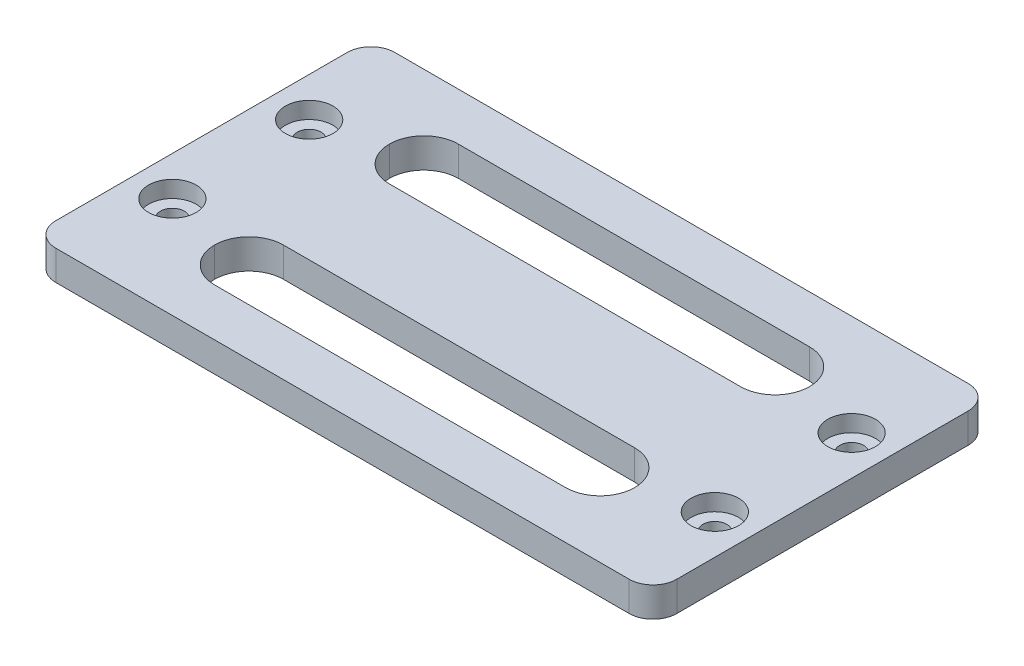
ISO-10303-21;
HEADER;
FILE_DESCRIPTION(('STEP AP214'),'2;1');
FILE_NAME('part.step','',(''),(''),'','','');
FILE_SCHEMA(('AUTOMOTIVE_DESIGN { 1 0 10303 214 1 1 1 1 }'));
ENDSEC;
DATA;
#1=APPLICATION_CONTEXT('core data for automotive mechanical design processes');
#2=APPLICATION_PROTOCOL_DEFINITION('international standard','automotive_design',2000,#1);
#3=PRODUCT_CONTEXT('',#1,'mechanical');
#4=PRODUCT('Part','Part','',(#3));
#5=PRODUCT_RELATED_PRODUCT_CATEGORY('part','',(#4));
#6=PRODUCT_DEFINITION_FORMATION('','',#4);
#7=PRODUCT_DEFINITION_CONTEXT('part definition',#1,'design');
#8=PRODUCT_DEFINITION('design','',#6,#7);
#9=PRODUCT_DEFINITION_SHAPE('','',#8);
#10=(LENGTH_UNIT() NAMED_UNIT(*) SI_UNIT(.MILLI.,.METRE.));
#11=(NAMED_UNIT(*) PLANE_ANGLE_UNIT() SI_UNIT($,.RADIAN.));
#12=(NAMED_UNIT(*) SI_UNIT($,.STERADIAN.) SOLID_ANGLE_UNIT());
#13=UNCERTAINTY_MEASURE_WITH_UNIT(LENGTH_MEASURE(1.E-05),#10,'distance_accuracy_value','');
#14=(GEOMETRIC_REPRESENTATION_CONTEXT(3) GLOBAL_UNCERTAINTY_ASSIGNED_CONTEXT((#13)) GLOBAL_UNIT_ASSIGNED_CONTEXT((#10,
#11,#12)) REPRESENTATION_CONTEXT('',''));
#15=CARTESIAN_POINT('',(0.,0.,0.));
#16=DIRECTION('',(0.,0.,1.));
#17=DIRECTION('',(1.,0.,0.));
#18=AXIS2_PLACEMENT_3D('',#15,#16,#17);
#19=CARTESIAN_POINT('',(22.8,2.5,-8.3));
#20=DIRECTION('',(0.,-1.,0.));
#21=DIRECTION('',(0.,0.,-1.));
#22=AXIS2_PLACEMENT_3D('',#19,#20,#21);
#23=CYLINDRICAL_SURFACE('',#22,1.);
#24=CARTESIAN_POINT('',(22.8,0.,-8.3));
#25=DIRECTION('',(0.,1.,0.));
#26=DIRECTION('',(0.,0.,1.));
#27=AXIS2_PLACEMENT_3D('',#24,#25,#26);
#28=CIRCLE('',#27,1.);
#29=CARTESIAN_POINT('',(22.8,0.,-7.29999999999999));
#30=VERTEX_POINT('',#29);
#31=EDGE_CURVE('E360',#30,#30,#28,.T.);
#32=ORIENTED_EDGE('',*,*,#31,.F.);
#33=EDGE_LOOP('',(#32));
#34=FACE_BOUND('',#33,.T.);
#35=CARTESIAN_POINT('',(22.8,1.1,-8.3));
#36=DIRECTION('',(0.,1.,0.));
#37=DIRECTION('',(0.,0.,1.));
#38=AXIS2_PLACEMENT_3D('',#35,#36,#37);
#39=CIRCLE('',#38,1.);
#40=CARTESIAN_POINT('',(22.8,1.1,-7.29999999999999));
#41=VERTEX_POINT('',#40);
#42=EDGE_CURVE('E40',#41,#41,#39,.T.);
#43=ORIENTED_EDGE('',*,*,#42,.T.);
#44=EDGE_LOOP('',(#43));
#45=FACE_BOUND('',#44,.T.);
#46=ADVANCED_FACE('F36',(#34,#45),#23,.F.);
#47=CARTESIAN_POINT('',(22.8,2.5,3.2));
#48=DIRECTION('',(0.,-1.,0.));
#49=DIRECTION('',(0.,0.,-1.));
#50=AXIS2_PLACEMENT_3D('',#47,#48,#49);
#51=CYLINDRICAL_SURFACE('',#50,1.);
#52=CARTESIAN_POINT('',(22.8,0.,3.2));
#53=DIRECTION('',(0.,1.,0.));
#54=DIRECTION('',(0.,0.,-1.));
#55=AXIS2_PLACEMENT_3D('',#52,#53,#54);
#56=CIRCLE('',#55,1.);
#57=CARTESIAN_POINT('',(22.8,0.,2.19999999999999));
#58=VERTEX_POINT('',#57);
#59=EDGE_CURVE('E363',#58,#58,#56,.T.);
#60=ORIENTED_EDGE('',*,*,#59,.F.);
#61=EDGE_LOOP('',(#60));
#62=FACE_BOUND('',#61,.T.);
#63=CARTESIAN_POINT('',(22.8,1.1,3.2));
#64=DIRECTION('',(0.,1.,0.));
#65=DIRECTION('',(0.,0.,1.));
#66=AXIS2_PLACEMENT_3D('',#63,#64,#65);
#67=CIRCLE('',#66,1.);
#68=CARTESIAN_POINT('',(22.8,1.1,4.2));
#69=VERTEX_POINT('',#68);
#70=EDGE_CURVE('E310',#69,#69,#67,.T.);
#71=ORIENTED_EDGE('',*,*,#70,.T.);
#72=EDGE_LOOP('',(#71));
#73=FACE_BOUND('',#72,.T.);
#74=ADVANCED_FACE('F414',(#62,#73),#51,.F.);
#75=CARTESIAN_POINT('',(-22.8,2.5,3.2));
#76=DIRECTION('',(0.,-1.,0.));
#77=DIRECTION('',(0.,0.,-1.));
#78=AXIS2_PLACEMENT_3D('',#75,#76,#77);
#79=CYLINDRICAL_SURFACE('',#78,1.);
#80=CARTESIAN_POINT('',(-22.8,0.,3.2));
#81=DIRECTION('',(0.,1.,0.));
#82=DIRECTION('',(0.,0.,1.));
#83=AXIS2_PLACEMENT_3D('',#80,#81,#82);
#84=CIRCLE('',#83,1.);
#85=CARTESIAN_POINT('',(-22.8,0.,4.2));
#86=VERTEX_POINT('',#85);
#87=EDGE_CURVE('E207',#86,#86,#84,.T.);
#88=ORIENTED_EDGE('',*,*,#87,.F.);
#89=EDGE_LOOP('',(#88));
#90=FACE_BOUND('',#89,.T.);
#91=CARTESIAN_POINT('',(-22.8,1.1,3.2));
#92=DIRECTION('',(0.,1.,0.));
#93=DIRECTION('',(0.,0.,1.));
#94=AXIS2_PLACEMENT_3D('',#91,#92,#93);
#95=CIRCLE('',#94,1.);
#96=CARTESIAN_POINT('',(-22.8,1.1,4.2));
#97=VERTEX_POINT('',#96);
#98=EDGE_CURVE('E306',#97,#97,#95,.T.);
#99=ORIENTED_EDGE('',*,*,#98,.T.);
#100=EDGE_LOOP('',(#99));
#101=FACE_BOUND('',#100,.T.);
#102=ADVANCED_FACE('F420',(#90,#101),#79,.F.);
#103=CARTESIAN_POINT('',(-22.8,2.5,-8.29999999999999));
#104=DIRECTION('',(0.,-1.,0.));
#105=DIRECTION('',(0.,0.,-1.));
#106=AXIS2_PLACEMENT_3D('',#103,#104,#105);
#107=CYLINDRICAL_SURFACE('',#106,1.);
#108=CARTESIAN_POINT('',(-22.8,0.,-8.29999999999999));
#109=DIRECTION('',(0.,1.,0.));
#110=DIRECTION('',(0.,0.,-1.));
#111=AXIS2_PLACEMENT_3D('',#108,#109,#110);
#112=CIRCLE('',#111,1.);
#113=CARTESIAN_POINT('',(-22.8,0.,-9.29999999999999));
#114=VERTEX_POINT('',#113);
#115=EDGE_CURVE('E354',#114,#114,#112,.T.);
#116=ORIENTED_EDGE('',*,*,#115,.F.);
#117=EDGE_LOOP('',(#116));
#118=FACE_BOUND('',#117,.T.);
#119=CARTESIAN_POINT('',(-22.8,1.1,-8.29999999999999));
#120=DIRECTION('',(0.,1.,0.));
#121=DIRECTION('',(0.,0.,1.));
#122=AXIS2_PLACEMENT_3D('',#119,#120,#121);
#123=CIRCLE('',#122,1.);
#124=CARTESIAN_POINT('',(-22.8,1.1,-7.29999999999999));
#125=VERTEX_POINT('',#124);
#126=EDGE_CURVE('E302',#125,#125,#123,.T.);
#127=ORIENTED_EDGE('',*,*,#126,.T.);
#128=EDGE_LOOP('',(#127));
#129=FACE_BOUND('',#128,.T.);
#130=ADVANCED_FACE('F426',(#118,#129),#107,.F.);
#131=CARTESIAN_POINT('',(0.,2.5,0.));
#132=DIRECTION('',(0.,-1.,0.));
#133=DIRECTION('',(0.,0.,-1.));
#134=AXIS2_PLACEMENT_3D('',#131,#132,#133);
#135=PLANE('',#134);
#136=CARTESIAN_POINT('',(22.8,2.5,-8.3));
#137=DIRECTION('',(0.,1.,0.));
#138=DIRECTION('',(0.,0.,1.));
#139=AXIS2_PLACEMENT_3D('',#136,#137,#138);
#140=CIRCLE('',#139,2.);
#141=CARTESIAN_POINT('',(22.8,2.5,-6.29999999999999));
#142=VERTEX_POINT('',#141);
#143=EDGE_CURVE('E326',#142,#142,#140,.T.);
#144=ORIENTED_EDGE('',*,*,#143,.F.);
#145=EDGE_LOOP('',(#144));
#146=FACE_BOUND('',#145,.T.);
#147=CARTESIAN_POINT('',(22.8,2.5,3.2));
#148=DIRECTION('',(0.,1.,0.));
#149=DIRECTION('',(0.,0.,1.));
#150=AXIS2_PLACEMENT_3D('',#147,#148,#149);
#151=CIRCLE('',#150,2.);
#152=CARTESIAN_POINT('',(22.8,2.5,5.2));
#153=VERTEX_POINT('',#152);
#154=EDGE_CURVE('E319',#153,#153,#151,.T.);
#155=ORIENTED_EDGE('',*,*,#154,.F.);
#156=EDGE_LOOP('',(#155));
#157=FACE_BOUND('',#156,.T.);
#158=CARTESIAN_POINT('',(-22.8,2.5,3.2));
#159=DIRECTION('',(0.,1.,0.));
#160=DIRECTION('',(0.,0.,1.));
#161=AXIS2_PLACEMENT_3D('',#158,#159,#160);
#162=CIRCLE('',#161,2.);
#163=CARTESIAN_POINT('',(-22.8,2.5,5.2));
#164=VERTEX_POINT('',#163);
#165=EDGE_CURVE('E312',#164,#164,#162,.T.);
#166=ORIENTED_EDGE('',*,*,#165,.F.);
#167=EDGE_LOOP('',(#166));
#168=FACE_BOUND('',#167,.T.);
#169=CARTESIAN_POINT('',(-22.8,2.5,-8.29999999999999));
#170=DIRECTION('',(0.,1.,0.));
#171=DIRECTION('',(0.,0.,1.));
#172=AXIS2_PLACEMENT_3D('',#169,#170,#171);
#173=CIRCLE('',#172,2.);
#174=CARTESIAN_POINT('',(-22.8,2.5,-6.29999999999999));
#175=VERTEX_POINT('',#174);
#176=EDGE_CURVE('E308',#175,#175,#173,.T.);
#177=ORIENTED_EDGE('',*,*,#176,.F.);
#178=EDGE_LOOP('',(#177));
#179=FACE_BOUND('',#178,.T.);
#180=DIRECTION('',(-1.,0.,0.));
#181=VECTOR('',#180,1.);
#182=CARTESIAN_POINT('',(-17.6603184164153,2.5,-12.8));
#183=LINE('',#182,#181);
#184=CARTESIAN_POINT('',(14.7603184164153,2.5,-12.8));
#185=VERTEX_POINT('',#184);
#186=CARTESIAN_POINT('',(-14.7603184164153,2.5,-12.8));
#187=VERTEX_POINT('',#186);
#188=EDGE_CURVE('E347',#185,#187,#183,.T.);
#189=ORIENTED_EDGE('',*,*,#188,.F.);
#190=CARTESIAN_POINT('',(14.7603184164153,2.5,-9.90000000000001));
#191=DIRECTION('',(0.,-1.,0.));
#192=DIRECTION('',(0.,0.,-1.));
#193=AXIS2_PLACEMENT_3D('',#190,#191,#192);
#194=CIRCLE('',#193,2.9);
#195=CARTESIAN_POINT('',(17.6603184164153,2.5,-9.90000000000001));
#196=VERTEX_POINT('',#195);
#197=EDGE_CURVE('E267',#185,#196,#194,.T.);
#198=ORIENTED_EDGE('',*,*,#197,.T.);
#199=CARTESIAN_POINT('',(14.7603184164153,2.5,-9.90000000000001));
#200=DIRECTION('',(0.,-1.,0.));
#201=DIRECTION('',(0.,0.,-1.));
#202=AXIS2_PLACEMENT_3D('',#199,#200,#201);
#203=CIRCLE('',#202,2.9);
#204=CARTESIAN_POINT('',(14.7603184164153,2.5,-7.00000000000001));
#205=VERTEX_POINT('',#204);
#206=EDGE_CURVE('E263',#196,#205,#203,.T.);
#207=ORIENTED_EDGE('',*,*,#206,.T.);
#208=DIRECTION('',(1.,0.,0.));
#209=VECTOR('',#208,1.);
#210=CARTESIAN_POINT('',(-17.6603184164153,2.5,-7.00000000000001));
#211=LINE('',#210,#209);
#212=CARTESIAN_POINT('',(-14.7603184164153,2.5,-7.00000000000001));
#213=VERTEX_POINT('',#212);
#214=EDGE_CURVE('E350',#213,#205,#211,.T.);
#215=ORIENTED_EDGE('',*,*,#214,.F.);
#216=CARTESIAN_POINT('',(-14.7603184164153,2.5,-9.90000000000001));
#217=DIRECTION('',(0.,-1.,0.));
#218=DIRECTION('',(0.,0.,-1.));
#219=AXIS2_PLACEMENT_3D('',#216,#217,#218);
#220=CIRCLE('',#219,2.9);
#221=CARTESIAN_POINT('',(-17.6603184164153,2.5,-9.90000000000001));
#222=VERTEX_POINT('',#221);
#223=EDGE_CURVE('E52',#213,#222,#220,.T.);
#224=ORIENTED_EDGE('',*,*,#223,.T.);
#225=CARTESIAN_POINT('',(-14.7603184164153,2.5,-9.90000000000001));
#226=DIRECTION('',(0.,-1.,0.));
#227=DIRECTION('',(0.,0.,-1.));
#228=AXIS2_PLACEMENT_3D('',#225,#226,#227);
#229=CIRCLE('',#228,2.9);
#230=EDGE_CURVE('E11',#222,#187,#229,.T.);
#231=ORIENTED_EDGE('',*,*,#230,.T.);
#232=EDGE_LOOP('',(#189,#198,#207,#215,#224,#231));
#233=FACE_BOUND('',#232,.T.);
#234=DIRECTION('',(0.,0.,-1.));
#235=VECTOR('',#234,1.);
#236=CARTESIAN_POINT('',(26.1,2.5,11.7));
#237=LINE('',#236,#235);
#238=CARTESIAN_POINT('',(26.1,2.5,9.7));
#239=VERTEX_POINT('',#238);
#240=CARTESIAN_POINT('',(26.1,2.5,-14.8));
#241=VERTEX_POINT('',#240);
#242=EDGE_CURVE('E213',#239,#241,#237,.T.);
#243=ORIENTED_EDGE('',*,*,#242,.T.);
#244=CARTESIAN_POINT('',(24.1,2.5,-14.8));
#245=DIRECTION('',(0.,-1.,0.));
#246=DIRECTION('',(0.,0.,-1.));
#247=AXIS2_PLACEMENT_3D('',#244,#245,#246);
#248=CIRCLE('',#247,2.);
#249=CARTESIAN_POINT('',(24.1,2.5,-16.8));
#250=VERTEX_POINT('',#249);
#251=EDGE_CURVE('E229',#241,#250,#248,.F.);
#252=ORIENTED_EDGE('',*,*,#251,.T.);
#253=DIRECTION('',(-1.,0.,0.));
#254=VECTOR('',#253,1.);
#255=CARTESIAN_POINT('',(-26.1,2.5,-16.8));
#256=LINE('',#255,#254);
#257=CARTESIAN_POINT('',(-24.1,2.5,-16.8));
#258=VERTEX_POINT('',#257);
#259=EDGE_CURVE('E194',#250,#258,#256,.T.);
#260=ORIENTED_EDGE('',*,*,#259,.T.);
#261=CARTESIAN_POINT('',(-24.1,2.5,-14.8));
#262=DIRECTION('',(0.,-1.,0.));
#263=DIRECTION('',(0.,0.,-1.));
#264=AXIS2_PLACEMENT_3D('',#261,#262,#263);
#265=CIRCLE('',#264,2.);
#266=CARTESIAN_POINT('',(-26.1,2.5,-14.8));
#267=VERTEX_POINT('',#266);
#268=EDGE_CURVE('E223',#258,#267,#265,.F.);
#269=ORIENTED_EDGE('',*,*,#268,.T.);
#270=DIRECTION('',(0.,0.,1.));
#271=VECTOR('',#270,1.);
#272=CARTESIAN_POINT('',(-26.1,2.5,11.7));
#273=LINE('',#272,#271);
#274=CARTESIAN_POINT('',(-26.1,2.5,9.7));
#275=VERTEX_POINT('',#274);
#276=EDGE_CURVE('E371',#267,#275,#273,.T.);
#277=ORIENTED_EDGE('',*,*,#276,.T.);
#278=CARTESIAN_POINT('',(-24.1,2.5,9.7));
#279=DIRECTION('',(0.,-1.,0.));
#280=DIRECTION('',(0.,0.,-1.));
#281=AXIS2_PLACEMENT_3D('',#278,#279,#280);
#282=CIRCLE('',#281,2.);
#283=CARTESIAN_POINT('',(-24.1,2.5,11.7));
#284=VERTEX_POINT('',#283);
#285=EDGE_CURVE('E225',#275,#284,#282,.F.);
#286=ORIENTED_EDGE('',*,*,#285,.T.);
#287=DIRECTION('',(1.,0.,0.));
#288=VECTOR('',#287,1.);
#289=CARTESIAN_POINT('',(-26.1,2.5,11.7));
#290=LINE('',#289,#288);
#291=CARTESIAN_POINT('',(24.1,2.5,11.7));
#292=VERTEX_POINT('',#291);
#293=EDGE_CURVE('E214',#284,#292,#290,.T.);
#294=ORIENTED_EDGE('',*,*,#293,.T.);
#295=CARTESIAN_POINT('',(24.1,2.5,9.7));
#296=DIRECTION('',(0.,-1.,0.));
#297=DIRECTION('',(0.,0.,-1.));
#298=AXIS2_PLACEMENT_3D('',#295,#296,#297);
#299=CIRCLE('',#298,2.);
#300=EDGE_CURVE('E227',#292,#239,#299,.F.);
#301=ORIENTED_EDGE('',*,*,#300,.T.);
#302=EDGE_LOOP('',(#243,#252,#260,#269,#277,#286,#294,#301));
#303=FACE_BOUND('',#302,.T.);
#304=CARTESIAN_POINT('',(-14.7603184164153,2.5,4.80000000000001));
#305=DIRECTION('',(0.,-1.,0.));
#306=DIRECTION('',(0.,0.,-1.));
#307=AXIS2_PLACEMENT_3D('',#304,#305,#306);
#308=CIRCLE('',#307,2.9);
#309=CARTESIAN_POINT('',(-14.7603184164153,2.5,7.70000000000001));
#310=VERTEX_POINT('',#309);
#311=CARTESIAN_POINT('',(-17.6603184164153,2.5,4.80000000000001));
#312=VERTEX_POINT('',#311);
#313=EDGE_CURVE('E279',#310,#312,#308,.T.);
#314=ORIENTED_EDGE('',*,*,#313,.T.);
#315=CARTESIAN_POINT('',(-14.7603184164153,2.5,4.80000000000001));
#316=DIRECTION('',(0.,-1.,0.));
#317=DIRECTION('',(0.,0.,-1.));
#318=AXIS2_PLACEMENT_3D('',#315,#316,#317);
#319=CIRCLE('',#318,2.9);
#320=CARTESIAN_POINT('',(-14.7603184164153,2.5,1.90000000000001));
#321=VERTEX_POINT('',#320);
#322=EDGE_CURVE('E283',#312,#321,#319,.T.);
#323=ORIENTED_EDGE('',*,*,#322,.T.);
#324=DIRECTION('',(-1.,0.,0.));
#325=VECTOR('',#324,1.);
#326=CARTESIAN_POINT('',(-17.6603184164153,2.5,1.90000000000001));
#327=LINE('',#326,#325);
#328=CARTESIAN_POINT('',(14.7603184164153,2.5,1.90000000000001));
#329=VERTEX_POINT('',#328);
#330=EDGE_CURVE('E338',#329,#321,#327,.T.);
#331=ORIENTED_EDGE('',*,*,#330,.F.);
#332=CARTESIAN_POINT('',(14.7603184164153,2.5,4.80000000000001));
#333=DIRECTION('',(0.,-1.,0.));
#334=DIRECTION('',(0.,0.,-1.));
#335=AXIS2_PLACEMENT_3D('',#332,#333,#334);
#336=CIRCLE('',#335,2.9);
#337=CARTESIAN_POINT('',(17.6603184164153,2.5,4.80000000000001));
#338=VERTEX_POINT('',#337);
#339=EDGE_CURVE('E275',#329,#338,#336,.T.);
#340=ORIENTED_EDGE('',*,*,#339,.T.);
#341=CARTESIAN_POINT('',(14.7603184164153,2.5,4.80000000000001));
#342=DIRECTION('',(0.,-1.,0.));
#343=DIRECTION('',(0.,0.,-1.));
#344=AXIS2_PLACEMENT_3D('',#341,#342,#343);
#345=CIRCLE('',#344,2.9);
#346=CARTESIAN_POINT('',(14.7603184164153,2.5,7.70000000000001));
#347=VERTEX_POINT('',#346);
#348=EDGE_CURVE('E271',#338,#347,#345,.T.);
#349=ORIENTED_EDGE('',*,*,#348,.T.);
#350=DIRECTION('',(1.,0.,0.));
#351=VECTOR('',#350,1.);
#352=CARTESIAN_POINT('',(-17.6603184164153,2.5,7.70000000000001));
#353=LINE('',#352,#351);
#354=EDGE_CURVE('E335',#310,#347,#353,.T.);
#355=ORIENTED_EDGE('',*,*,#354,.F.);
#356=EDGE_LOOP('',(#314,#323,#331,#340,#349,#355));
#357=FACE_BOUND('',#356,.T.);
#358=ADVANCED_FACE('F377',(#146,#157,#168,#179,#233,#303,#357),#135,.F.);
#359=CARTESIAN_POINT('',(0.,0.,0.));
#360=DIRECTION('',(0.,-1.,0.));
#361=DIRECTION('',(0.,0.,-1.));
#362=AXIS2_PLACEMENT_3D('',#359,#360,#361);
#363=PLANE('',#362);
#364=DIRECTION('',(-1.,0.,0.));
#365=VECTOR('',#364,1.);
#366=CARTESIAN_POINT('',(-17.6603184164153,0.,-12.8));
#367=LINE('',#366,#365);
#368=CARTESIAN_POINT('',(14.7603184164153,0.,-12.8));
#369=VERTEX_POINT('',#368);
#370=CARTESIAN_POINT('',(-14.7603184164153,0.,-12.8));
#371=VERTEX_POINT('',#370);
#372=EDGE_CURVE('E342',#369,#371,#367,.T.);
#373=ORIENTED_EDGE('',*,*,#372,.T.);
#374=CARTESIAN_POINT('',(-14.7603184164153,0.,-9.90000000000001));
#375=DIRECTION('',(0.,-1.,0.));
#376=DIRECTION('',(0.,0.,-1.));
#377=AXIS2_PLACEMENT_3D('',#374,#375,#376);
#378=CIRCLE('',#377,2.9);
#379=CARTESIAN_POINT('',(-17.6603184164153,0.,-9.90000000000001));
#380=VERTEX_POINT('',#379);
#381=EDGE_CURVE('E45',#371,#380,#378,.F.);
#382=ORIENTED_EDGE('',*,*,#381,.T.);
#383=CARTESIAN_POINT('',(-14.7603184164153,0.,-9.90000000000001));
#384=DIRECTION('',(0.,-1.,0.));
#385=DIRECTION('',(0.,0.,-1.));
#386=AXIS2_PLACEMENT_3D('',#383,#384,#385);
#387=CIRCLE('',#386,2.9);
#388=CARTESIAN_POINT('',(-14.7603184164153,0.,-7.00000000000001));
#389=VERTEX_POINT('',#388);
#390=EDGE_CURVE('E285',#380,#389,#387,.F.);
#391=ORIENTED_EDGE('',*,*,#390,.T.);
#392=DIRECTION('',(1.,0.,0.));
#393=VECTOR('',#392,1.);
#394=CARTESIAN_POINT('',(-17.6603184164153,0.,-7.00000000000001));
#395=LINE('',#394,#393);
#396=CARTESIAN_POINT('',(14.7603184164153,0.,-7.00000000000001));
#397=VERTEX_POINT('',#396);
#398=EDGE_CURVE('E351',#389,#397,#395,.T.);
#399=ORIENTED_EDGE('',*,*,#398,.T.);
#400=CARTESIAN_POINT('',(14.7603184164153,0.,-9.90000000000001));
#401=DIRECTION('',(0.,-1.,0.));
#402=DIRECTION('',(0.,0.,-1.));
#403=AXIS2_PLACEMENT_3D('',#400,#401,#402);
#404=CIRCLE('',#403,2.9);
#405=CARTESIAN_POINT('',(17.6603184164153,0.,-9.90000000000001));
#406=VERTEX_POINT('',#405);
#407=EDGE_CURVE('E261',#397,#406,#404,.F.);
#408=ORIENTED_EDGE('',*,*,#407,.T.);
#409=CARTESIAN_POINT('',(14.7603184164153,0.,-9.90000000000001));
#410=DIRECTION('',(0.,-1.,0.));
#411=DIRECTION('',(0.,0.,-1.));
#412=AXIS2_PLACEMENT_3D('',#409,#410,#411);
#413=CIRCLE('',#412,2.9);
#414=EDGE_CURVE('E265',#406,#369,#413,.F.);
#415=ORIENTED_EDGE('',*,*,#414,.T.);
#416=EDGE_LOOP('',(#373,#382,#391,#399,#408,#415));
#417=FACE_BOUND('',#416,.T.);
#418=ORIENTED_EDGE('',*,*,#31,.T.);
#419=EDGE_LOOP('',(#418));
#420=FACE_BOUND('',#419,.T.);
#421=ORIENTED_EDGE('',*,*,#87,.T.);
#422=EDGE_LOOP('',(#421));
#423=FACE_BOUND('',#422,.T.);
#424=DIRECTION('',(-1.,0.,0.));
#425=VECTOR('',#424,1.);
#426=CARTESIAN_POINT('',(-26.1,0.,-16.8));
#427=LINE('',#426,#425);
#428=CARTESIAN_POINT('',(24.1,0.,-16.8));
#429=VERTEX_POINT('',#428);
#430=CARTESIAN_POINT('',(-24.1,0.,-16.8));
#431=VERTEX_POINT('',#430);
#432=EDGE_CURVE('E191',#429,#431,#427,.T.);
#433=ORIENTED_EDGE('',*,*,#432,.F.);
#434=CARTESIAN_POINT('',(24.1,0.,-14.8));
#435=DIRECTION('',(0.,-1.,0.));
#436=DIRECTION('',(0.,0.,-1.));
#437=AXIS2_PLACEMENT_3D('',#434,#435,#436);
#438=CIRCLE('',#437,2.);
#439=CARTESIAN_POINT('',(26.1,0.,-14.8));
#440=VERTEX_POINT('',#439);
#441=EDGE_CURVE('E174',#429,#440,#438,.T.);
#442=ORIENTED_EDGE('',*,*,#441,.T.);
#443=DIRECTION('',(0.,0.,-1.));
#444=VECTOR('',#443,1.);
#445=CARTESIAN_POINT('',(26.1,0.,11.7));
#446=LINE('',#445,#444);
#447=CARTESIAN_POINT('',(26.1,0.,9.7));
#448=VERTEX_POINT('',#447);
#449=EDGE_CURVE('E202',#448,#440,#446,.T.);
#450=ORIENTED_EDGE('',*,*,#449,.F.);
#451=CARTESIAN_POINT('',(24.1,0.,9.7));
#452=DIRECTION('',(0.,-1.,0.));
#453=DIRECTION('',(0.,0.,-1.));
#454=AXIS2_PLACEMENT_3D('',#451,#452,#453);
#455=CIRCLE('',#454,2.);
#456=CARTESIAN_POINT('',(24.1,0.,11.7));
#457=VERTEX_POINT('',#456);
#458=EDGE_CURVE('E185',#448,#457,#455,.T.);
#459=ORIENTED_EDGE('',*,*,#458,.T.);
#460=DIRECTION('',(1.,0.,0.));
#461=VECTOR('',#460,1.);
#462=CARTESIAN_POINT('',(-26.1,0.,11.7));
#463=LINE('',#462,#461);
#464=CARTESIAN_POINT('',(-24.1,0.,11.7));
#465=VERTEX_POINT('',#464);
#466=EDGE_CURVE('E205',#465,#457,#463,.T.);
#467=ORIENTED_EDGE('',*,*,#466,.F.);
#468=CARTESIAN_POINT('',(-24.1,0.,9.7));
#469=DIRECTION('',(0.,-1.,0.));
#470=DIRECTION('',(0.,0.,-1.));
#471=AXIS2_PLACEMENT_3D('',#468,#469,#470);
#472=CIRCLE('',#471,2.);
#473=CARTESIAN_POINT('',(-26.1,0.,9.7));
#474=VERTEX_POINT('',#473);
#475=EDGE_CURVE('E217',#465,#474,#472,.T.);
#476=ORIENTED_EDGE('',*,*,#475,.T.);
#477=DIRECTION('',(0.,0.,1.));
#478=VECTOR('',#477,1.);
#479=CARTESIAN_POINT('',(-26.1,0.,11.7));
#480=LINE('',#479,#478);
#481=CARTESIAN_POINT('',(-26.1,0.,-14.8));
#482=VERTEX_POINT('',#481);
#483=EDGE_CURVE('E201',#482,#474,#480,.T.);
#484=ORIENTED_EDGE('',*,*,#483,.F.);
#485=CARTESIAN_POINT('',(-24.1,0.,-14.8));
#486=DIRECTION('',(0.,-1.,0.));
#487=DIRECTION('',(0.,0.,-1.));
#488=AXIS2_PLACEMENT_3D('',#485,#486,#487);
#489=CIRCLE('',#488,2.);
#490=EDGE_CURVE('E195',#482,#431,#489,.T.);
#491=ORIENTED_EDGE('',*,*,#490,.T.);
#492=EDGE_LOOP('',(#433,#442,#450,#459,#467,#476,#484,#491));
#493=FACE_BOUND('',#492,.T.);
#494=ORIENTED_EDGE('',*,*,#59,.T.);
#495=EDGE_LOOP('',(#494));
#496=FACE_BOUND('',#495,.T.);
#497=ORIENTED_EDGE('',*,*,#115,.T.);
#498=EDGE_LOOP('',(#497));
#499=FACE_BOUND('',#498,.T.);
#500=CARTESIAN_POINT('',(14.7603184164153,0.,4.80000000000001));
#501=DIRECTION('',(0.,-1.,0.));
#502=DIRECTION('',(0.,0.,-1.));
#503=AXIS2_PLACEMENT_3D('',#500,#501,#502);
#504=CIRCLE('',#503,2.9);
#505=CARTESIAN_POINT('',(14.7603184164153,0.,7.70000000000001));
#506=VERTEX_POINT('',#505);
#507=CARTESIAN_POINT('',(17.6603184164153,0.,4.80000000000001));
#508=VERTEX_POINT('',#507);
#509=EDGE_CURVE('E269',#506,#508,#504,.F.);
#510=ORIENTED_EDGE('',*,*,#509,.T.);
#511=CARTESIAN_POINT('',(14.7603184164153,0.,4.80000000000001));
#512=DIRECTION('',(0.,-1.,0.));
#513=DIRECTION('',(0.,0.,-1.));
#514=AXIS2_PLACEMENT_3D('',#511,#512,#513);
#515=CIRCLE('',#514,2.9);
#516=CARTESIAN_POINT('',(14.7603184164153,0.,1.90000000000001));
#517=VERTEX_POINT('',#516);
#518=EDGE_CURVE('E273',#508,#517,#515,.F.);
#519=ORIENTED_EDGE('',*,*,#518,.T.);
#520=DIRECTION('',(-1.,0.,0.));
#521=VECTOR('',#520,1.);
#522=CARTESIAN_POINT('',(-17.6603184164153,0.,1.90000000000001));
#523=LINE('',#522,#521);
#524=CARTESIAN_POINT('',(-14.7603184164153,0.,1.90000000000001));
#525=VERTEX_POINT('',#524);
#526=EDGE_CURVE('E339',#517,#525,#523,.T.);
#527=ORIENTED_EDGE('',*,*,#526,.T.);
#528=CARTESIAN_POINT('',(-14.7603184164153,0.,4.80000000000001));
#529=DIRECTION('',(0.,-1.,0.));
#530=DIRECTION('',(0.,0.,-1.));
#531=AXIS2_PLACEMENT_3D('',#528,#529,#530);
#532=CIRCLE('',#531,2.9);
#533=CARTESIAN_POINT('',(-17.6603184164153,0.,4.80000000000001));
#534=VERTEX_POINT('',#533);
#535=EDGE_CURVE('E281',#525,#534,#532,.F.);
#536=ORIENTED_EDGE('',*,*,#535,.T.);
#537=CARTESIAN_POINT('',(-14.7603184164153,0.,4.80000000000001));
#538=DIRECTION('',(0.,-1.,0.));
#539=DIRECTION('',(0.,0.,-1.));
#540=AXIS2_PLACEMENT_3D('',#537,#538,#539);
#541=CIRCLE('',#540,2.9);
#542=CARTESIAN_POINT('',(-14.7603184164153,0.,7.70000000000001));
#543=VERTEX_POINT('',#542);
#544=EDGE_CURVE('E277',#534,#543,#541,.F.);
#545=ORIENTED_EDGE('',*,*,#544,.T.);
#546=DIRECTION('',(1.,0.,0.));
#547=VECTOR('',#546,1.);
#548=CARTESIAN_POINT('',(-17.6603184164153,0.,7.70000000000001));
#549=LINE('',#548,#547);
#550=EDGE_CURVE('E292',#543,#506,#549,.T.);
#551=ORIENTED_EDGE('',*,*,#550,.T.);
#552=EDGE_LOOP('',(#510,#519,#527,#536,#545,#551));
#553=FACE_BOUND('',#552,.T.);
#554=ADVANCED_FACE('F198',(#417,#420,#423,#493,#496,#499,#553),#363,.T.);
#555=CARTESIAN_POINT('',(26.1,2.5,11.7));
#556=DIRECTION('',(-1.,0.,0.));
#557=DIRECTION('',(0.,0.,1.));
#558=AXIS2_PLACEMENT_3D('',#555,#556,#557);
#559=PLANE('',#558);
#560=ORIENTED_EDGE('',*,*,#449,.T.);
#561=DIRECTION('',(0.,-1.,0.));
#562=VECTOR('',#561,1.);
#563=CARTESIAN_POINT('',(26.1,2.5,-14.8));
#564=LINE('',#563,#562);
#565=EDGE_CURVE('E179',#440,#241,#564,.F.);
#566=ORIENTED_EDGE('',*,*,#565,.T.);
#567=ORIENTED_EDGE('',*,*,#242,.F.);
#568=DIRECTION('',(0.,-1.,0.));
#569=VECTOR('',#568,1.);
#570=CARTESIAN_POINT('',(26.1,2.5,9.7));
#571=LINE('',#570,#569);
#572=EDGE_CURVE('E184',#239,#448,#571,.T.);
#573=ORIENTED_EDGE('',*,*,#572,.T.);
#574=EDGE_LOOP('',(#560,#566,#567,#573));
#575=FACE_BOUND('',#574,.T.);
#576=ADVANCED_FACE('F388',(#575),#559,.F.);
#577=CARTESIAN_POINT('',(-26.1,2.5,-16.8));
#578=DIRECTION('',(0.,0.,1.));
#579=DIRECTION('',(1.,0.,0.));
#580=AXIS2_PLACEMENT_3D('',#577,#578,#579);
#581=PLANE('',#580);
#582=ORIENTED_EDGE('',*,*,#259,.F.);
#583=DIRECTION('',(0.,-1.,0.));
#584=VECTOR('',#583,1.);
#585=CARTESIAN_POINT('',(24.1,2.5,-16.8));
#586=LINE('',#585,#584);
#587=EDGE_CURVE('E178',#250,#429,#586,.T.);
#588=ORIENTED_EDGE('',*,*,#587,.T.);
#589=ORIENTED_EDGE('',*,*,#432,.T.);
#590=DIRECTION('',(0.,-1.,0.));
#591=VECTOR('',#590,1.);
#592=CARTESIAN_POINT('',(-24.1,2.5,-16.8));
#593=LINE('',#592,#591);
#594=EDGE_CURVE('E196',#431,#258,#593,.F.);
#595=ORIENTED_EDGE('',*,*,#594,.T.);
#596=EDGE_LOOP('',(#582,#588,#589,#595));
#597=FACE_BOUND('',#596,.T.);
#598=ADVANCED_FACE('F190',(#597),#581,.F.);
#599=CARTESIAN_POINT('',(-26.1,2.5,11.7));
#600=DIRECTION('',(1.,0.,0.));
#601=DIRECTION('',(0.,0.,-1.));
#602=AXIS2_PLACEMENT_3D('',#599,#600,#601);
#603=PLANE('',#602);
#604=ORIENTED_EDGE('',*,*,#483,.T.);
#605=DIRECTION('',(0.,-1.,0.));
#606=VECTOR('',#605,1.);
#607=CARTESIAN_POINT('',(-26.1,2.5,9.7));
#608=LINE('',#607,#606);
#609=EDGE_CURVE('E239',#474,#275,#608,.F.);
#610=ORIENTED_EDGE('',*,*,#609,.T.);
#611=ORIENTED_EDGE('',*,*,#276,.F.);
#612=DIRECTION('',(0.,-1.,0.));
#613=VECTOR('',#612,1.);
#614=CARTESIAN_POINT('',(-26.1,2.5,-14.8));
#615=LINE('',#614,#613);
#616=EDGE_CURVE('E236',#267,#482,#615,.T.);
#617=ORIENTED_EDGE('',*,*,#616,.T.);
#618=EDGE_LOOP('',(#604,#610,#611,#617));
#619=FACE_BOUND('',#618,.T.);
#620=ADVANCED_FACE('F395',(#619),#603,.F.);
#621=CARTESIAN_POINT('',(-26.1,2.5,11.7));
#622=DIRECTION('',(0.,0.,-1.));
#623=DIRECTION('',(-1.,0.,0.));
#624=AXIS2_PLACEMENT_3D('',#621,#622,#623);
#625=PLANE('',#624);
#626=ORIENTED_EDGE('',*,*,#466,.T.);
#627=DIRECTION('',(0.,-1.,0.));
#628=VECTOR('',#627,1.);
#629=CARTESIAN_POINT('',(24.1,2.5,11.7));
#630=LINE('',#629,#628);
#631=EDGE_CURVE('E234',#457,#292,#630,.F.);
#632=ORIENTED_EDGE('',*,*,#631,.T.);
#633=ORIENTED_EDGE('',*,*,#293,.F.);
#634=DIRECTION('',(0.,-1.,0.));
#635=VECTOR('',#634,1.);
#636=CARTESIAN_POINT('',(-24.1,2.5,11.7));
#637=LINE('',#636,#635);
#638=EDGE_CURVE('E231',#284,#465,#637,.T.);
#639=ORIENTED_EDGE('',*,*,#638,.T.);
#640=EDGE_LOOP('',(#626,#632,#633,#639));
#641=FACE_BOUND('',#640,.T.);
#642=ADVANCED_FACE('F390',(#641),#625,.F.);
#643=CARTESIAN_POINT('',(-17.6603184164153,2.5,-12.8));
#644=DIRECTION('',(0.,0.,1.));
#645=DIRECTION('',(1.,0.,0.));
#646=AXIS2_PLACEMENT_3D('',#643,#644,#645);
#647=PLANE('',#646);
#648=ORIENTED_EDGE('',*,*,#372,.F.);
#649=DIRECTION('',(0.,-1.,0.));
#650=VECTOR('',#649,1.);
#651=CARTESIAN_POINT('',(14.7603184164153,2.5,-12.8));
#652=LINE('',#651,#650);
#653=EDGE_CURVE('E249',#369,#185,#652,.F.);
#654=ORIENTED_EDGE('',*,*,#653,.T.);
#655=ORIENTED_EDGE('',*,*,#188,.T.);
#656=DIRECTION('',(0.,-1.,0.));
#657=VECTOR('',#656,1.);
#658=CARTESIAN_POINT('',(-14.7603184164153,0.,-12.8));
#659=LINE('',#658,#657);
#660=EDGE_CURVE('E247',#187,#371,#659,.T.);
#661=ORIENTED_EDGE('',*,*,#660,.T.);
#662=EDGE_LOOP('',(#648,#654,#655,#661));
#663=FACE_BOUND('',#662,.T.);
#664=ADVANCED_FACE('F439',(#663),#647,.T.);
#665=CARTESIAN_POINT('',(-17.6603184164153,2.5,-7.00000000000001));
#666=DIRECTION('',(0.,0.,-1.));
#667=DIRECTION('',(-1.,0.,0.));
#668=AXIS2_PLACEMENT_3D('',#665,#666,#667);
#669=PLANE('',#668);
#670=ORIENTED_EDGE('',*,*,#214,.T.);
#671=DIRECTION('',(0.,-1.,0.));
#672=VECTOR('',#671,1.);
#673=CARTESIAN_POINT('',(14.7603184164153,0.,-7.00000000000001));
#674=LINE('',#673,#672);
#675=EDGE_CURVE('E244',#205,#397,#674,.T.);
#676=ORIENTED_EDGE('',*,*,#675,.T.);
#677=ORIENTED_EDGE('',*,*,#398,.F.);
#678=DIRECTION('',(0.,-1.,0.));
#679=VECTOR('',#678,1.);
#680=CARTESIAN_POINT('',(-14.7603184164153,2.5,-7.00000000000001));
#681=LINE('',#680,#679);
#682=EDGE_CURVE('E241',#389,#213,#681,.F.);
#683=ORIENTED_EDGE('',*,*,#682,.T.);
#684=EDGE_LOOP('',(#670,#676,#677,#683));
#685=FACE_BOUND('',#684,.T.);
#686=ADVANCED_FACE('F481',(#685),#669,.T.);
#687=CARTESIAN_POINT('',(-17.6603184164153,2.5,7.70000000000001));
#688=DIRECTION('',(0.,0.,-1.));
#689=DIRECTION('',(-1.,0.,0.));
#690=AXIS2_PLACEMENT_3D('',#687,#688,#689);
#691=PLANE('',#690);
#692=ORIENTED_EDGE('',*,*,#354,.T.);
#693=DIRECTION('',(0.,-1.,0.));
#694=VECTOR('',#693,1.);
#695=CARTESIAN_POINT('',(14.7603184164153,0.,7.70000000000001));
#696=LINE('',#695,#694);
#697=EDGE_CURVE('E254',#347,#506,#696,.T.);
#698=ORIENTED_EDGE('',*,*,#697,.T.);
#699=ORIENTED_EDGE('',*,*,#550,.F.);
#700=DIRECTION('',(0.,-1.,0.));
#701=VECTOR('',#700,1.);
#702=CARTESIAN_POINT('',(-14.7603184164153,2.5,7.70000000000001));
#703=LINE('',#702,#701);
#704=EDGE_CURVE('E251',#543,#310,#703,.F.);
#705=ORIENTED_EDGE('',*,*,#704,.T.);
#706=EDGE_LOOP('',(#692,#698,#699,#705));
#707=FACE_BOUND('',#706,.T.);
#708=ADVANCED_FACE('F491',(#707),#691,.T.);
#709=CARTESIAN_POINT('',(-17.6603184164153,2.5,1.90000000000001));
#710=DIRECTION('',(0.,0.,1.));
#711=DIRECTION('',(1.,0.,0.));
#712=AXIS2_PLACEMENT_3D('',#709,#710,#711);
#713=PLANE('',#712);
#714=ORIENTED_EDGE('',*,*,#526,.F.);
#715=DIRECTION('',(0.,-1.,0.));
#716=VECTOR('',#715,1.);
#717=CARTESIAN_POINT('',(14.7603184164153,2.5,1.90000000000001));
#718=LINE('',#717,#716);
#719=EDGE_CURVE('E259',#517,#329,#718,.F.);
#720=ORIENTED_EDGE('',*,*,#719,.T.);
#721=ORIENTED_EDGE('',*,*,#330,.T.);
#722=DIRECTION('',(0.,-1.,0.));
#723=VECTOR('',#722,1.);
#724=CARTESIAN_POINT('',(-14.7603184164153,0.,1.90000000000001));
#725=LINE('',#724,#723);
#726=EDGE_CURVE('E257',#321,#525,#725,.T.);
#727=ORIENTED_EDGE('',*,*,#726,.T.);
#728=EDGE_LOOP('',(#714,#720,#721,#727));
#729=FACE_BOUND('',#728,.T.);
#730=ADVANCED_FACE('F448',(#729),#713,.T.);
#731=CARTESIAN_POINT('',(24.1,2.5,-14.8));
#732=DIRECTION('',(0.,-1.,0.));
#733=DIRECTION('',(0.,0.,-1.));
#734=AXIS2_PLACEMENT_3D('',#731,#732,#733);
#735=CYLINDRICAL_SURFACE('',#734,2.);
#736=ORIENTED_EDGE('',*,*,#251,.F.);
#737=ORIENTED_EDGE('',*,*,#565,.F.);
#738=ORIENTED_EDGE('',*,*,#441,.F.);
#739=ORIENTED_EDGE('',*,*,#587,.F.);
#740=EDGE_LOOP('',(#736,#737,#738,#739));
#741=FACE_BOUND('',#740,.T.);
#742=ADVANCED_FACE('F177',(#741),#735,.T.);
#743=CARTESIAN_POINT('',(24.1,2.5,9.7));
#744=DIRECTION('',(0.,-1.,0.));
#745=DIRECTION('',(0.,0.,-1.));
#746=AXIS2_PLACEMENT_3D('',#743,#744,#745);
#747=CYLINDRICAL_SURFACE('',#746,2.);
#748=ORIENTED_EDGE('',*,*,#300,.F.);
#749=ORIENTED_EDGE('',*,*,#631,.F.);
#750=ORIENTED_EDGE('',*,*,#458,.F.);
#751=ORIENTED_EDGE('',*,*,#572,.F.);
#752=EDGE_LOOP('',(#748,#749,#750,#751));
#753=FACE_BOUND('',#752,.T.);
#754=ADVANCED_FACE('F386',(#753),#747,.T.);
#755=CARTESIAN_POINT('',(-24.1,2.5,9.7));
#756=DIRECTION('',(0.,-1.,0.));
#757=DIRECTION('',(0.,0.,-1.));
#758=AXIS2_PLACEMENT_3D('',#755,#756,#757);
#759=CYLINDRICAL_SURFACE('',#758,2.);
#760=ORIENTED_EDGE('',*,*,#285,.F.);
#761=ORIENTED_EDGE('',*,*,#609,.F.);
#762=ORIENTED_EDGE('',*,*,#475,.F.);
#763=ORIENTED_EDGE('',*,*,#638,.F.);
#764=EDGE_LOOP('',(#760,#761,#762,#763));
#765=FACE_BOUND('',#764,.T.);
#766=ADVANCED_FACE('F392',(#765),#759,.T.);
#767=CARTESIAN_POINT('',(-24.1,2.5,-14.8));
#768=DIRECTION('',(0.,-1.,0.));
#769=DIRECTION('',(0.,0.,-1.));
#770=AXIS2_PLACEMENT_3D('',#767,#768,#769);
#771=CYLINDRICAL_SURFACE('',#770,2.);
#772=ORIENTED_EDGE('',*,*,#268,.F.);
#773=ORIENTED_EDGE('',*,*,#594,.F.);
#774=ORIENTED_EDGE('',*,*,#490,.F.);
#775=ORIENTED_EDGE('',*,*,#616,.F.);
#776=EDGE_LOOP('',(#772,#773,#774,#775));
#777=FACE_BOUND('',#776,.T.);
#778=ADVANCED_FACE('F400',(#777),#771,.T.);
#779=CARTESIAN_POINT('',(14.7603184164153,2.5,-9.90000000000001));
#780=DIRECTION('',(0.,1.,0.));
#781=DIRECTION('',(0.,0.,1.));
#782=AXIS2_PLACEMENT_3D('',#779,#780,#781);
#783=CYLINDRICAL_SURFACE('',#782,2.9);
#784=DIRECTION('',(0.,-1.,0.));
#785=VECTOR('',#784,1.);
#786=CARTESIAN_POINT('',(17.6603184164153,0.,-9.90000000000001));
#787=LINE('',#786,#785);
#788=EDGE_CURVE('E289',#196,#406,#787,.T.);
#789=ORIENTED_EDGE('',*,*,#788,.F.);
#790=ORIENTED_EDGE('',*,*,#197,.F.);
#791=ORIENTED_EDGE('',*,*,#653,.F.);
#792=ORIENTED_EDGE('',*,*,#414,.F.);
#793=EDGE_LOOP('',(#789,#790,#791,#792));
#794=FACE_BOUND('',#793,.T.);
#795=ADVANCED_FACE('F402',(#794),#783,.F.);
#796=CARTESIAN_POINT('',(14.7603184164153,2.5,-9.90000000000001));
#797=DIRECTION('',(0.,1.,0.));
#798=DIRECTION('',(0.,0.,1.));
#799=AXIS2_PLACEMENT_3D('',#796,#797,#798);
#800=CYLINDRICAL_SURFACE('',#799,2.9);
#801=ORIENTED_EDGE('',*,*,#206,.F.);
#802=ORIENTED_EDGE('',*,*,#788,.T.);
#803=ORIENTED_EDGE('',*,*,#407,.F.);
#804=ORIENTED_EDGE('',*,*,#675,.F.);
#805=EDGE_LOOP('',(#801,#802,#803,#804));
#806=FACE_BOUND('',#805,.T.);
#807=ADVANCED_FACE('F408',(#806),#800,.F.);
#808=CARTESIAN_POINT('',(14.7603184164153,2.5,4.80000000000001));
#809=DIRECTION('',(0.,1.,0.));
#810=DIRECTION('',(0.,0.,1.));
#811=AXIS2_PLACEMENT_3D('',#808,#809,#810);
#812=CYLINDRICAL_SURFACE('',#811,2.9);
#813=DIRECTION('',(0.,-1.,0.));
#814=VECTOR('',#813,1.);
#815=CARTESIAN_POINT('',(17.6603184164153,0.,4.80000000000001));
#816=LINE('',#815,#814);
#817=EDGE_CURVE('E293',#338,#508,#816,.T.);
#818=ORIENTED_EDGE('',*,*,#817,.F.);
#819=ORIENTED_EDGE('',*,*,#339,.F.);
#820=ORIENTED_EDGE('',*,*,#719,.F.);
#821=ORIENTED_EDGE('',*,*,#518,.F.);
#822=EDGE_LOOP('',(#818,#819,#820,#821));
#823=FACE_BOUND('',#822,.T.);
#824=ADVANCED_FACE('F524',(#823),#812,.F.);
#825=CARTESIAN_POINT('',(14.7603184164153,2.5,4.80000000000001));
#826=DIRECTION('',(0.,1.,0.));
#827=DIRECTION('',(0.,0.,1.));
#828=AXIS2_PLACEMENT_3D('',#825,#826,#827);
#829=CYLINDRICAL_SURFACE('',#828,2.9);
#830=ORIENTED_EDGE('',*,*,#348,.F.);
#831=ORIENTED_EDGE('',*,*,#817,.T.);
#832=ORIENTED_EDGE('',*,*,#509,.F.);
#833=ORIENTED_EDGE('',*,*,#697,.F.);
#834=EDGE_LOOP('',(#830,#831,#832,#833));
#835=FACE_BOUND('',#834,.T.);
#836=ADVANCED_FACE('F533',(#835),#829,.F.);
#837=CARTESIAN_POINT('',(-14.7603184164153,2.5,4.80000000000001));
#838=DIRECTION('',(0.,1.,0.));
#839=DIRECTION('',(0.,0.,1.));
#840=AXIS2_PLACEMENT_3D('',#837,#838,#839);
#841=CYLINDRICAL_SURFACE('',#840,2.9);
#842=ORIENTED_EDGE('',*,*,#726,.F.);
#843=ORIENTED_EDGE('',*,*,#322,.F.);
#844=DIRECTION('',(0.,-1.,0.));
#845=VECTOR('',#844,1.);
#846=CARTESIAN_POINT('',(-17.6603184164153,2.5,4.80000000000001));
#847=LINE('',#846,#845);
#848=EDGE_CURVE('E296',#534,#312,#847,.F.);
#849=ORIENTED_EDGE('',*,*,#848,.F.);
#850=ORIENTED_EDGE('',*,*,#535,.F.);
#851=EDGE_LOOP('',(#842,#843,#849,#850));
#852=FACE_BOUND('',#851,.T.);
#853=ADVANCED_FACE('F543',(#852),#841,.F.);
#854=CARTESIAN_POINT('',(-14.7603184164153,2.5,4.80000000000001));
#855=DIRECTION('',(0.,1.,0.));
#856=DIRECTION('',(0.,0.,1.));
#857=AXIS2_PLACEMENT_3D('',#854,#855,#856);
#858=CYLINDRICAL_SURFACE('',#857,2.9);
#859=ORIENTED_EDGE('',*,*,#313,.F.);
#860=ORIENTED_EDGE('',*,*,#704,.F.);
#861=ORIENTED_EDGE('',*,*,#544,.F.);
#862=ORIENTED_EDGE('',*,*,#848,.T.);
#863=EDGE_LOOP('',(#859,#860,#861,#862));
#864=FACE_BOUND('',#863,.T.);
#865=ADVANCED_FACE('F553',(#864),#858,.F.);
#866=CARTESIAN_POINT('',(-14.7603184164153,2.5,-9.90000000000001));
#867=DIRECTION('',(0.,1.,0.));
#868=DIRECTION('',(0.,0.,1.));
#869=AXIS2_PLACEMENT_3D('',#866,#867,#868);
#870=CYLINDRICAL_SURFACE('',#869,2.9);
#871=ORIENTED_EDGE('',*,*,#660,.F.);
#872=ORIENTED_EDGE('',*,*,#230,.F.);
#873=DIRECTION('',(0.,-1.,0.));
#874=VECTOR('',#873,1.);
#875=CARTESIAN_POINT('',(-17.6603184164153,2.5,-9.90000000000001));
#876=LINE('',#875,#874);
#877=EDGE_CURVE('E299',#380,#222,#876,.F.);
#878=ORIENTED_EDGE('',*,*,#877,.F.);
#879=ORIENTED_EDGE('',*,*,#381,.F.);
#880=EDGE_LOOP('',(#871,#872,#878,#879));
#881=FACE_BOUND('',#880,.T.);
#882=ADVANCED_FACE('F38',(#881),#870,.F.);
#883=CARTESIAN_POINT('',(-14.7603184164153,2.5,-9.90000000000001));
#884=DIRECTION('',(0.,1.,0.));
#885=DIRECTION('',(0.,0.,1.));
#886=AXIS2_PLACEMENT_3D('',#883,#884,#885);
#887=CYLINDRICAL_SURFACE('',#886,2.9);
#888=ORIENTED_EDGE('',*,*,#223,.F.);
#889=ORIENTED_EDGE('',*,*,#682,.F.);
#890=ORIENTED_EDGE('',*,*,#390,.F.);
#891=ORIENTED_EDGE('',*,*,#877,.T.);
#892=EDGE_LOOP('',(#888,#889,#890,#891));
#893=FACE_BOUND('',#892,.T.);
#894=ADVANCED_FACE('F572',(#893),#887,.F.);
#895=CARTESIAN_POINT('',(-22.8,1.1,-8.29999999999999));
#896=DIRECTION('',(0.,1.,0.));
#897=DIRECTION('',(0.,0.,1.));
#898=AXIS2_PLACEMENT_3D('',#895,#896,#897);
#899=CYLINDRICAL_SURFACE('',#898,2.);
#900=CARTESIAN_POINT('',(-22.8,1.1,-8.29999999999999));
#901=DIRECTION('',(0.,1.,0.));
#902=DIRECTION('',(0.,0.,1.));
#903=AXIS2_PLACEMENT_3D('',#900,#901,#902);
#904=CIRCLE('',#903,2.);
#905=CARTESIAN_POINT('',(-22.8,1.1,-6.29999999999999));
#906=VERTEX_POINT('',#905);
#907=EDGE_CURVE('E305',#906,#906,#904,.T.);
#908=ORIENTED_EDGE('',*,*,#907,.F.);
#909=EDGE_LOOP('',(#908));
#910=FACE_BOUND('',#909,.T.);
#911=ORIENTED_EDGE('',*,*,#176,.T.);
#912=EDGE_LOOP('',(#911));
#913=FACE_BOUND('',#912,.T.);
#914=ADVANCED_FACE('F580',(#910,#913),#899,.F.);
#915=CARTESIAN_POINT('',(-22.8,1.1,-8.29999999999999));
#916=DIRECTION('',(0.,1.,0.));
#917=DIRECTION('',(0.,0.,1.));
#918=AXIS2_PLACEMENT_3D('',#915,#916,#917);
#919=PLANE('',#918);
#920=ORIENTED_EDGE('',*,*,#126,.F.);
#921=EDGE_LOOP('',(#920));
#922=FACE_BOUND('',#921,.T.);
#923=ORIENTED_EDGE('',*,*,#907,.T.);
#924=EDGE_LOOP('',(#923));
#925=FACE_BOUND('',#924,.T.);
#926=ADVANCED_FACE('F619',(#922,#925),#919,.T.);
#927=CARTESIAN_POINT('',(-22.8,1.1,3.2));
#928=DIRECTION('',(0.,1.,0.));
#929=DIRECTION('',(0.,0.,1.));
#930=AXIS2_PLACEMENT_3D('',#927,#928,#929);
#931=CYLINDRICAL_SURFACE('',#930,2.);
#932=CARTESIAN_POINT('',(-22.8,1.1,3.2));
#933=DIRECTION('',(0.,1.,0.));
#934=DIRECTION('',(0.,0.,1.));
#935=AXIS2_PLACEMENT_3D('',#932,#933,#934);
#936=CIRCLE('',#935,2.);
#937=CARTESIAN_POINT('',(-22.8,1.1,5.2));
#938=VERTEX_POINT('',#937);
#939=EDGE_CURVE('E309',#938,#938,#936,.T.);
#940=ORIENTED_EDGE('',*,*,#939,.F.);
#941=EDGE_LOOP('',(#940));
#942=FACE_BOUND('',#941,.T.);
#943=ORIENTED_EDGE('',*,*,#165,.T.);
#944=EDGE_LOOP('',(#943));
#945=FACE_BOUND('',#944,.T.);
#946=ADVANCED_FACE('F629',(#942,#945),#931,.F.);
#947=CARTESIAN_POINT('',(-22.8,1.1,3.2));
#948=DIRECTION('',(0.,1.,0.));
#949=DIRECTION('',(0.,0.,1.));
#950=AXIS2_PLACEMENT_3D('',#947,#948,#949);
#951=PLANE('',#950);
#952=ORIENTED_EDGE('',*,*,#98,.F.);
#953=EDGE_LOOP('',(#952));
#954=FACE_BOUND('',#953,.T.);
#955=ORIENTED_EDGE('',*,*,#939,.T.);
#956=EDGE_LOOP('',(#955));
#957=FACE_BOUND('',#956,.T.);
#958=ADVANCED_FACE('F639',(#954,#957),#951,.T.);
#959=CARTESIAN_POINT('',(22.8,1.1,3.2));
#960=DIRECTION('',(0.,1.,0.));
#961=DIRECTION('',(0.,0.,1.));
#962=AXIS2_PLACEMENT_3D('',#959,#960,#961);
#963=CYLINDRICAL_SURFACE('',#962,2.);
#964=CARTESIAN_POINT('',(22.8,1.1,3.2));
#965=DIRECTION('',(0.,1.,0.));
#966=DIRECTION('',(0.,0.,1.));
#967=AXIS2_PLACEMENT_3D('',#964,#965,#966);
#968=CIRCLE('',#967,2.);
#969=CARTESIAN_POINT('',(22.8,1.1,5.2));
#970=VERTEX_POINT('',#969);
#971=EDGE_CURVE('E313',#970,#970,#968,.T.);
#972=ORIENTED_EDGE('',*,*,#971,.F.);
#973=EDGE_LOOP('',(#972));
#974=FACE_BOUND('',#973,.T.);
#975=ORIENTED_EDGE('',*,*,#154,.T.);
#976=EDGE_LOOP('',(#975));
#977=FACE_BOUND('',#976,.T.);
#978=ADVANCED_FACE('F649',(#974,#977),#963,.F.);
#979=CARTESIAN_POINT('',(22.8,1.1,3.2));
#980=DIRECTION('',(0.,1.,0.));
#981=DIRECTION('',(0.,0.,1.));
#982=AXIS2_PLACEMENT_3D('',#979,#980,#981);
#983=PLANE('',#982);
#984=ORIENTED_EDGE('',*,*,#70,.F.);
#985=EDGE_LOOP('',(#984));
#986=FACE_BOUND('',#985,.T.);
#987=ORIENTED_EDGE('',*,*,#971,.T.);
#988=EDGE_LOOP('',(#987));
#989=FACE_BOUND('',#988,.T.);
#990=ADVANCED_FACE('F659',(#986,#989),#983,.T.);
#991=CARTESIAN_POINT('',(22.8,1.1,-8.3));
#992=DIRECTION('',(0.,1.,0.));
#993=DIRECTION('',(0.,0.,1.));
#994=AXIS2_PLACEMENT_3D('',#991,#992,#993);
#995=CYLINDRICAL_SURFACE('',#994,2.);
#996=CARTESIAN_POINT('',(22.8,1.1,-8.3));
#997=DIRECTION('',(0.,1.,0.));
#998=DIRECTION('',(0.,0.,1.));
#999=AXIS2_PLACEMENT_3D('',#996,#997,#998);
#1000=CIRCLE('',#999,2.);
#1001=CARTESIAN_POINT('',(22.8,1.1,-6.29999999999999));
#1002=VERTEX_POINT('',#1001);
#1003=EDGE_CURVE('E698',#1002,#1002,#1000,.T.);
#1004=ORIENTED_EDGE('',*,*,#1003,.F.);
#1005=EDGE_LOOP('',(#1004));
#1006=FACE_BOUND('',#1005,.T.);
#1007=ORIENTED_EDGE('',*,*,#143,.T.);
#1008=EDGE_LOOP('',(#1007));
#1009=FACE_BOUND('',#1008,.T.);
#1010=ADVANCED_FACE('F669',(#1006,#1009),#995,.F.);
#1011=CARTESIAN_POINT('',(22.8,1.1,-8.3));
#1012=DIRECTION('',(0.,1.,0.));
#1013=DIRECTION('',(0.,0.,1.));
#1014=AXIS2_PLACEMENT_3D('',#1011,#1012,#1013);
#1015=PLANE('',#1014);
#1016=ORIENTED_EDGE('',*,*,#42,.F.);
#1017=EDGE_LOOP('',(#1016));
#1018=FACE_BOUND('',#1017,.T.);
#1019=ORIENTED_EDGE('',*,*,#1003,.T.);
#1020=EDGE_LOOP('',(#1019));
#1021=FACE_BOUND('',#1020,.T.);
#1022=ADVANCED_FACE('F679',(#1018,#1021),#1015,.T.);
#1023=CLOSED_SHELL('',(#46,#74,#102,#130,#358,#554,#576,#598,#620,#642,#664,#686,#708,#730,#742,
#754,#766,#778,#795,#807,#824,#836,#853,#865,#882,#894,#914,#926,#946,#958,#978,#990,#1010,#1022));
#1024=MANIFOLD_SOLID_BREP('B2',#1023);
#1025=ADVANCED_BREP_SHAPE_REPRESENTATION('',(#18,#1024),#14);
#1026=SHAPE_DEFINITION_REPRESENTATION(#9,#1025);
ENDSEC;
END-ISO-10303-21;
